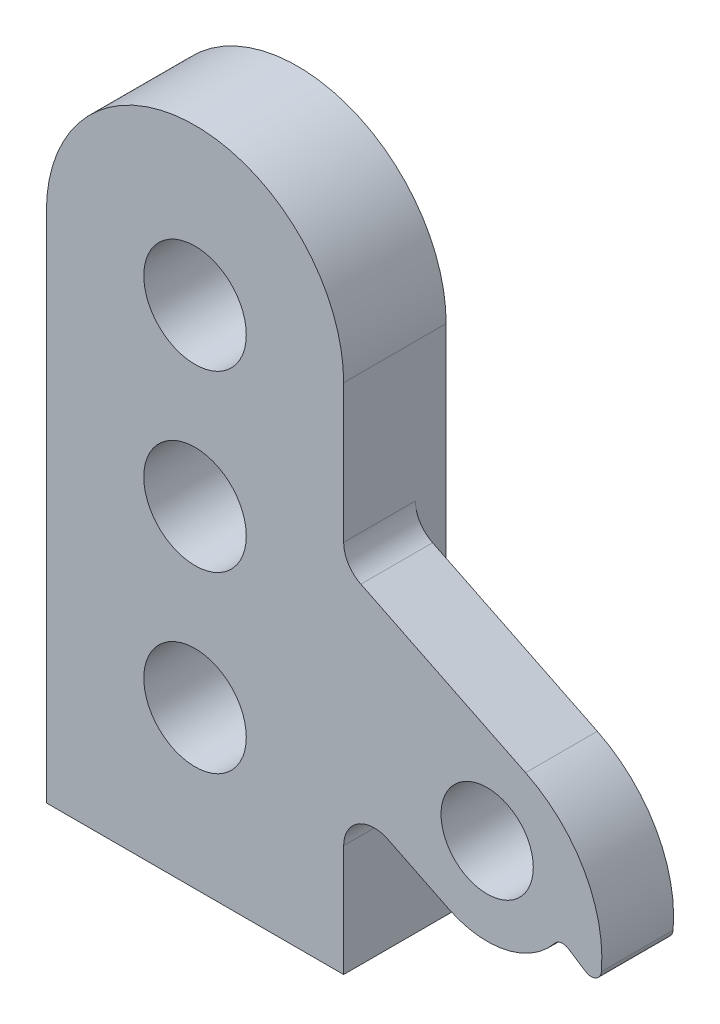
ISO-10303-21;
HEADER;
FILE_DESCRIPTION(('STEP AP214'),'2;1');
FILE_NAME('part.step','',(''),(''),'','','');
FILE_SCHEMA(('AUTOMOTIVE_DESIGN { 1 0 10303 214 1 1 1 1 }'));
ENDSEC;
DATA;
#1=APPLICATION_CONTEXT('core data for automotive mechanical design processes');
#2=APPLICATION_PROTOCOL_DEFINITION('international standard','automotive_design',2000,#1);
#3=PRODUCT_CONTEXT('',#1,'mechanical');
#4=PRODUCT('Part','Part','',(#3));
#5=PRODUCT_RELATED_PRODUCT_CATEGORY('part','',(#4));
#6=PRODUCT_DEFINITION_FORMATION('','',#4);
#7=PRODUCT_DEFINITION_CONTEXT('part definition',#1,'design');
#8=PRODUCT_DEFINITION('design','',#6,#7);
#9=PRODUCT_DEFINITION_SHAPE('','',#8);
#10=(LENGTH_UNIT() NAMED_UNIT(*) SI_UNIT(.MILLI.,.METRE.));
#11=(NAMED_UNIT(*) PLANE_ANGLE_UNIT() SI_UNIT($,.RADIAN.));
#12=(NAMED_UNIT(*) SI_UNIT($,.STERADIAN.) SOLID_ANGLE_UNIT());
#13=UNCERTAINTY_MEASURE_WITH_UNIT(LENGTH_MEASURE(1.E-05),#10,'distance_accuracy_value','');
#14=(GEOMETRIC_REPRESENTATION_CONTEXT(3) GLOBAL_UNCERTAINTY_ASSIGNED_CONTEXT((#13)) GLOBAL_UNIT_ASSIGNED_CONTEXT((#10,
#11,#12)) REPRESENTATION_CONTEXT('',''));
#15=CARTESIAN_POINT('',(0.,0.,0.));
#16=DIRECTION('',(0.,0.,1.));
#17=DIRECTION('',(1.,0.,0.));
#18=AXIS2_PLACEMENT_3D('',#15,#16,#17);
#19=CARTESIAN_POINT('',(0.,25.,-3.));
#20=DIRECTION('',(0.,0.,1.));
#21=DIRECTION('',(1.,0.,0.));
#22=AXIS2_PLACEMENT_3D('',#19,#20,#21);
#23=PLANE('',#22);
#24=CARTESIAN_POINT('',(0.,-9.70000000000001,-3.));
#25=DIRECTION('',(0.,0.,1.));
#26=DIRECTION('',(1.,0.,0.));
#27=AXIS2_PLACEMENT_3D('',#24,#25,#26);
#28=CIRCLE('',#27,5.);
#29=CARTESIAN_POINT('',(5.,-9.70000000000001,-3.));
#30=VERTEX_POINT('',#29);
#31=EDGE_CURVE('E354',#30,#30,#28,.T.);
#32=ORIENTED_EDGE('',*,*,#31,.T.);
#33=EDGE_LOOP('',(#32));
#34=FACE_BOUND('',#33,.T.);
#35=CARTESIAN_POINT('',(0.,24.3,-3.));
#36=DIRECTION('',(0.,0.,1.));
#37=DIRECTION('',(1.,0.,0.));
#38=AXIS2_PLACEMENT_3D('',#35,#36,#37);
#39=CIRCLE('',#38,5.);
#40=CARTESIAN_POINT('',(5.,24.3,-3.));
#41=VERTEX_POINT('',#40);
#42=EDGE_CURVE('E356',#41,#41,#39,.T.);
#43=ORIENTED_EDGE('',*,*,#42,.T.);
#44=EDGE_LOOP('',(#43));
#45=FACE_BOUND('',#44,.T.);
#46=CARTESIAN_POINT('',(0.,7.29999999999999,-3.));
#47=DIRECTION('',(0.,0.,-1.));
#48=DIRECTION('',(-1.,0.,0.));
#49=AXIS2_PLACEMENT_3D('',#46,#47,#48);
#50=CIRCLE('',#49,5.00000000000001);
#51=CARTESIAN_POINT('',(-5.,7.29999999999999,-3.));
#52=VERTEX_POINT('',#51);
#53=EDGE_CURVE('E291',#52,#52,#50,.T.);
#54=ORIENTED_EDGE('',*,*,#53,.F.);
#55=EDGE_LOOP('',(#54));
#56=FACE_BOUND('',#55,.T.);
#57=DIRECTION('',(1.,0.,0.));
#58=VECTOR('',#57,1.);
#59=CARTESIAN_POINT('',(-14.5,-18.,-3.));
#60=LINE('',#59,#58);
#61=CARTESIAN_POINT('',(-14.5,-18.,-3.));
#62=VERTEX_POINT('',#61);
#63=CARTESIAN_POINT('',(14.5,-18.,-3.));
#64=VERTEX_POINT('',#63);
#65=EDGE_CURVE('E54',#62,#64,#60,.T.);
#66=ORIENTED_EDGE('',*,*,#65,.F.);
#67=DIRECTION('',(0.,1.,0.));
#68=VECTOR('',#67,1.);
#69=CARTESIAN_POINT('',(-14.5,25.,-3.));
#70=LINE('',#69,#68);
#71=CARTESIAN_POINT('',(-14.5,25.,-3.));
#72=VERTEX_POINT('',#71);
#73=EDGE_CURVE('E175',#62,#72,#70,.T.);
#74=ORIENTED_EDGE('',*,*,#73,.T.);
#75=CARTESIAN_POINT('',(0.,25.,-3.));
#76=DIRECTION('',(0.,0.,-1.));
#77=DIRECTION('',(1.,0.,0.));
#78=AXIS2_PLACEMENT_3D('',#75,#76,#77);
#79=CIRCLE('',#78,14.5);
#80=CARTESIAN_POINT('',(14.5,25.,-3.));
#81=VERTEX_POINT('',#80);
#82=EDGE_CURVE('E289',#72,#81,#79,.T.);
#83=ORIENTED_EDGE('',*,*,#82,.T.);
#84=DIRECTION('',(0.,-1.,0.));
#85=VECTOR('',#84,1.);
#86=CARTESIAN_POINT('',(14.5,-25.,-3.));
#87=LINE('',#86,#85);
#88=EDGE_CURVE('E290',#81,#64,#87,.T.);
#89=ORIENTED_EDGE('',*,*,#88,.T.);
#90=EDGE_LOOP('',(#66,#74,#83,#89));
#91=FACE_BOUND('',#90,.T.);
#92=ADVANCED_FACE('F37',(#34,#45,#56,#91),#23,.F.);
#93=CARTESIAN_POINT('',(0.,0.,0.));
#94=DIRECTION('',(0.,0.,1.));
#95=DIRECTION('',(1.,0.,0.));
#96=AXIS2_PLACEMENT_3D('',#93,#94,#95);
#97=PLANE('',#96);
#98=CARTESIAN_POINT('',(28.5,-6.70000000000001,0.));
#99=DIRECTION('',(0.,0.,1.));
#100=DIRECTION('',(1.,0.,0.));
#101=AXIS2_PLACEMENT_3D('',#98,#99,#100);
#102=CIRCLE('',#101,4.5);
#103=CARTESIAN_POINT('',(33.,-6.70000000000001,0.));
#104=VERTEX_POINT('',#103);
#105=EDGE_CURVE('E171',#104,#104,#102,.T.);
#106=ORIENTED_EDGE('',*,*,#105,.T.);
#107=EDGE_LOOP('',(#106));
#108=FACE_BOUND('',#107,.T.);
#109=DIRECTION('',(0.,-1.,0.));
#110=VECTOR('',#109,1.);
#111=CARTESIAN_POINT('',(14.5,-25.,0.));
#112=LINE('',#111,#110);
#113=CARTESIAN_POINT('',(14.5,11.516103688213,0.));
#114=VERTEX_POINT('',#113);
#115=CARTESIAN_POINT('',(14.5,-14.1090861443534,0.));
#116=VERTEX_POINT('',#115);
#117=EDGE_CURVE('E11',#114,#116,#112,.T.);
#118=ORIENTED_EDGE('',*,*,#117,.F.);
#119=CARTESIAN_POINT('',(17.5,11.516103688213,0.));
#120=DIRECTION('',(0.,0.,1.));
#121=DIRECTION('',(1.,0.,0.));
#122=AXIS2_PLACEMENT_3D('',#119,#120,#121);
#123=CIRCLE('',#122,3.);
#124=CARTESIAN_POINT('',(16.1772883610396,8.82344070890074,0.));
#125=VERTEX_POINT('',#124);
#126=EDGE_CURVE('E191',#114,#125,#123,.T.);
#127=ORIENTED_EDGE('',*,*,#126,.T.);
#128=DIRECTION('',(-0.897554326437415,0.440903879653467,0.));
#129=VECTOR('',#128,1.);
#130=CARTESIAN_POINT('',(6.63654982555434,13.5101192877356,0.));
#131=LINE('',#130,#129);
#132=CARTESIAN_POINT('',(32.2476829770545,0.929211774718015,0.));
#133=VERTEX_POINT('',#132);
#134=EDGE_CURVE('E188',#133,#125,#131,.T.);
#135=ORIENTED_EDGE('',*,*,#134,.F.);
#136=CARTESIAN_POINT('',(26.3790265018417,-11.0176960498222,0.));
#137=DIRECTION('',(0.,0.,1.));
#138=DIRECTION('',(1.,0.,0.));
#139=AXIS2_PLACEMENT_3D('',#136,#137,#138);
#140=CIRCLE('',#139,13.3105122137399);
#141=CARTESIAN_POINT('',(39.6377712447958,-12.1904804431811,0.));
#142=VERTEX_POINT('',#141);
#143=EDGE_CURVE('E185',#133,#142,#140,.F.);
#144=ORIENTED_EDGE('',*,*,#143,.T.);
#145=CARTESIAN_POINT('',(38.6416604618262,-12.1023708066379,0.));
#146=DIRECTION('',(0.,0.,1.));
#147=DIRECTION('',(1.,0.,0.));
#148=AXIS2_PLACEMENT_3D('',#145,#146,#147);
#149=CIRCLE('',#148,0.999999999999944);
#150=CARTESIAN_POINT('',(38.0964892709571,-12.9406955483974,0.));
#151=VERTEX_POINT('',#150);
#152=EDGE_CURVE('E182',#142,#151,#149,.F.);
#153=ORIENTED_EDGE('',*,*,#152,.T.);
#154=DIRECTION('',(0.838324741759615,-0.545171190869139,0.));
#155=VECTOR('',#154,1.);
#156=CARTESIAN_POINT('',(5.40842704431872,8.31668709057398,0.));
#157=LINE('',#156,#155);
#158=CARTESIAN_POINT('',(36.4198397874379,-11.8503531666591,0.));
#159=VERTEX_POINT('',#158);
#160=EDGE_CURVE('E179',#159,#151,#157,.T.);
#161=ORIENTED_EDGE('',*,*,#160,.F.);
#162=CARTESIAN_POINT('',(35.8746685965687,-12.6886779084188,0.));
#163=DIRECTION('',(0.,0.,1.));
#164=DIRECTION('',(1.,0.,0.));
#165=AXIS2_PLACEMENT_3D('',#162,#163,#164);
#166=CIRCLE('',#165,1.00000000000007);
#167=CARTESIAN_POINT('',(35.0983876916668,-12.0582907601641,0.));
#168=VERTEX_POINT('',#167);
#169=EDGE_CURVE('E177',#168,#159,#166,.F.);
#170=ORIENTED_EDGE('',*,*,#169,.F.);
#171=CARTESIAN_POINT('',(28.5,-6.70000000000001,0.));
#172=DIRECTION('',(0.,0.,1.));
#173=DIRECTION('',(1.,0.,0.));
#174=AXIS2_PLACEMENT_3D('',#171,#172,#173);
#175=CIRCLE('',#174,8.5);
#176=CARTESIAN_POINT('',(24.7523170229455,-14.329211774718,0.));
#177=VERTEX_POINT('',#176);
#178=EDGE_CURVE('E174',#177,#168,#175,.T.);
#179=ORIENTED_EDGE('',*,*,#178,.F.);
#180=DIRECTION('',(-0.897554326437415,0.440903879653467,0.));
#181=VECTOR('',#180,1.);
#182=CARTESIAN_POINT('',(-0.858816128554595,-1.74830426170043,0.));
#183=LINE('',#182,#181);
#184=CARTESIAN_POINT('',(18.8227116389605,-11.4164231650412,0.));
#185=VERTEX_POINT('',#184);
#186=EDGE_CURVE('E196',#177,#185,#183,.T.);
#187=ORIENTED_EDGE('',*,*,#186,.T.);
#188=CARTESIAN_POINT('',(17.5,-14.1090861443534,0.));
#189=DIRECTION('',(0.,0.,1.));
#190=DIRECTION('',(1.,0.,0.));
#191=AXIS2_PLACEMENT_3D('',#188,#189,#190);
#192=CIRCLE('',#191,3.);
#193=EDGE_CURVE('E194',#116,#185,#192,.F.);
#194=ORIENTED_EDGE('',*,*,#193,.F.);
#195=EDGE_LOOP('',(#118,#127,#135,#144,#153,#161,#170,#179,#187,#194));
#196=FACE_BOUND('',#195,.T.);
#197=ADVANCED_FACE('F228',(#108,#196),#97,.F.);
#198=CARTESIAN_POINT('',(28.5,-6.70000000000001,7.));
#199=DIRECTION('',(0.,0.,-1.));
#200=DIRECTION('',(-1.,0.,0.));
#201=AXIS2_PLACEMENT_3D('',#198,#199,#200);
#202=CYLINDRICAL_SURFACE('',#201,8.5);
#203=ORIENTED_EDGE('',*,*,#178,.T.);
#204=DIRECTION('',(0.,0.,-1.));
#205=VECTOR('',#204,1.);
#206=CARTESIAN_POINT('',(35.0983876916668,-12.0582907601641,7.));
#207=LINE('',#206,#205);
#208=CARTESIAN_POINT('',(35.0983876916668,-12.0582907601641,7.));
#209=VERTEX_POINT('',#208);
#210=EDGE_CURVE('E46',#209,#168,#207,.T.);
#211=ORIENTED_EDGE('',*,*,#210,.F.);
#212=CARTESIAN_POINT('',(28.5,-6.70000000000001,7.));
#213=DIRECTION('',(0.,0.,1.));
#214=DIRECTION('',(1.,0.,0.));
#215=AXIS2_PLACEMENT_3D('',#212,#213,#214);
#216=CIRCLE('',#215,8.5);
#217=CARTESIAN_POINT('',(24.7523170229455,-14.329211774718,7.));
#218=VERTEX_POINT('',#217);
#219=EDGE_CURVE('E265',#218,#209,#216,.T.);
#220=ORIENTED_EDGE('',*,*,#219,.F.);
#221=DIRECTION('',(0.,0.,-1.));
#222=VECTOR('',#221,1.);
#223=CARTESIAN_POINT('',(24.7523170229455,-14.329211774718,7.));
#224=LINE('',#223,#222);
#225=EDGE_CURVE('E63',#218,#177,#224,.T.);
#226=ORIENTED_EDGE('',*,*,#225,.T.);
#227=EDGE_LOOP('',(#203,#211,#220,#226));
#228=FACE_BOUND('',#227,.T.);
#229=ADVANCED_FACE('F226',(#228),#202,.T.);
#230=CARTESIAN_POINT('',(35.8746685965687,-12.6886779084188,7.));
#231=DIRECTION('',(0.,0.,-1.));
#232=DIRECTION('',(-1.,0.,0.));
#233=AXIS2_PLACEMENT_3D('',#230,#231,#232);
#234=CYLINDRICAL_SURFACE('',#233,1.00000000000007);
#235=ORIENTED_EDGE('',*,*,#169,.T.);
#236=DIRECTION('',(0.,0.,-1.));
#237=VECTOR('',#236,1.);
#238=CARTESIAN_POINT('',(36.4198397874379,-11.8503531666591,7.));
#239=LINE('',#238,#237);
#240=CARTESIAN_POINT('',(36.4198397874379,-11.8503531666591,7.));
#241=VERTEX_POINT('',#240);
#242=EDGE_CURVE('E222',#241,#159,#239,.T.);
#243=ORIENTED_EDGE('',*,*,#242,.F.);
#244=CARTESIAN_POINT('',(35.8746685965687,-12.6886779084188,7.));
#245=DIRECTION('',(0.,0.,1.));
#246=DIRECTION('',(1.,0.,0.));
#247=AXIS2_PLACEMENT_3D('',#244,#245,#246);
#248=CIRCLE('',#247,1.00000000000007);
#249=EDGE_CURVE('E105',#209,#241,#248,.F.);
#250=ORIENTED_EDGE('',*,*,#249,.F.);
#251=ORIENTED_EDGE('',*,*,#210,.T.);
#252=EDGE_LOOP('',(#235,#243,#250,#251));
#253=FACE_BOUND('',#252,.T.);
#254=ADVANCED_FACE('F225',(#253),#234,.F.);
#255=CARTESIAN_POINT('',(5.40842704431872,8.31668709057398,7.));
#256=DIRECTION('',(0.545171190869139,0.838324741759615,0.));
#257=DIRECTION('',(-0.838324741759615,0.545171190869139,0.));
#258=AXIS2_PLACEMENT_3D('',#255,#256,#257);
#259=PLANE('',#258);
#260=ORIENTED_EDGE('',*,*,#160,.T.);
#261=DIRECTION('',(0.,0.,-1.));
#262=VECTOR('',#261,1.);
#263=CARTESIAN_POINT('',(38.0964892709571,-12.9406955483974,7.));
#264=LINE('',#263,#262);
#265=CARTESIAN_POINT('',(38.0964892709571,-12.9406955483974,7.));
#266=VERTEX_POINT('',#265);
#267=EDGE_CURVE('E220',#266,#151,#264,.T.);
#268=ORIENTED_EDGE('',*,*,#267,.F.);
#269=DIRECTION('',(0.838324741759615,-0.545171190869139,0.));
#270=VECTOR('',#269,1.);
#271=CARTESIAN_POINT('',(5.40842704431872,8.31668709057398,7.));
#272=LINE('',#271,#270);
#273=EDGE_CURVE('E261',#241,#266,#272,.T.);
#274=ORIENTED_EDGE('',*,*,#273,.F.);
#275=ORIENTED_EDGE('',*,*,#242,.T.);
#276=EDGE_LOOP('',(#260,#268,#274,#275));
#277=FACE_BOUND('',#276,.T.);
#278=ADVANCED_FACE('F259',(#277),#259,.F.);
#279=CARTESIAN_POINT('',(38.6416604618262,-12.1023708066379,7.));
#280=DIRECTION('',(0.,0.,-1.));
#281=DIRECTION('',(-1.,0.,0.));
#282=AXIS2_PLACEMENT_3D('',#279,#280,#281);
#283=CYLINDRICAL_SURFACE('',#282,0.999999999999944);
#284=ORIENTED_EDGE('',*,*,#152,.F.);
#285=DIRECTION('',(0.,0.,-1.));
#286=VECTOR('',#285,1.);
#287=CARTESIAN_POINT('',(39.6377712447958,-12.1904804431811,7.));
#288=LINE('',#287,#286);
#289=CARTESIAN_POINT('',(39.6377712447958,-12.1904804431811,7.));
#290=VERTEX_POINT('',#289);
#291=EDGE_CURVE('E218',#290,#142,#288,.T.);
#292=ORIENTED_EDGE('',*,*,#291,.F.);
#293=CARTESIAN_POINT('',(38.6416604618262,-12.1023708066379,7.));
#294=DIRECTION('',(0.,0.,1.));
#295=DIRECTION('',(1.,0.,0.));
#296=AXIS2_PLACEMENT_3D('',#293,#294,#295);
#297=CIRCLE('',#296,0.999999999999944);
#298=EDGE_CURVE('E262',#290,#266,#297,.F.);
#299=ORIENTED_EDGE('',*,*,#298,.T.);
#300=ORIENTED_EDGE('',*,*,#267,.T.);
#301=EDGE_LOOP('',(#284,#292,#299,#300));
#302=FACE_BOUND('',#301,.T.);
#303=ADVANCED_FACE('F256',(#302),#283,.T.);
#304=CARTESIAN_POINT('',(26.3790265018417,-11.0176960498222,7.));
#305=DIRECTION('',(0.,0.,-1.));
#306=DIRECTION('',(-1.,0.,0.));
#307=AXIS2_PLACEMENT_3D('',#304,#305,#306);
#308=CYLINDRICAL_SURFACE('',#307,13.3105122137399);
#309=ORIENTED_EDGE('',*,*,#143,.F.);
#310=DIRECTION('',(0.,0.,-1.));
#311=VECTOR('',#310,1.);
#312=CARTESIAN_POINT('',(32.2476829770545,0.929211774718015,7.));
#313=LINE('',#312,#311);
#314=CARTESIAN_POINT('',(32.2476829770545,0.929211774718015,7.));
#315=VERTEX_POINT('',#314);
#316=EDGE_CURVE('E216',#315,#133,#313,.T.);
#317=ORIENTED_EDGE('',*,*,#316,.F.);
#318=CARTESIAN_POINT('',(26.3790265018417,-11.0176960498222,7.));
#319=DIRECTION('',(0.,0.,1.));
#320=DIRECTION('',(1.,0.,0.));
#321=AXIS2_PLACEMENT_3D('',#318,#319,#320);
#322=CIRCLE('',#321,13.3105122137399);
#323=EDGE_CURVE('E252',#315,#290,#322,.F.);
#324=ORIENTED_EDGE('',*,*,#323,.T.);
#325=ORIENTED_EDGE('',*,*,#291,.T.);
#326=EDGE_LOOP('',(#309,#317,#324,#325));
#327=FACE_BOUND('',#326,.T.);
#328=ADVANCED_FACE('F248',(#327),#308,.T.);
#329=CARTESIAN_POINT('',(6.63654982555434,13.5101192877356,7.));
#330=DIRECTION('',(-0.440903879653467,-0.897554326437415,0.));
#331=DIRECTION('',(0.897554326437415,-0.440903879653467,0.));
#332=AXIS2_PLACEMENT_3D('',#329,#330,#331);
#333=PLANE('',#332);
#334=ORIENTED_EDGE('',*,*,#134,.T.);
#335=DIRECTION('',(0.,0.,-1.));
#336=VECTOR('',#335,1.);
#337=CARTESIAN_POINT('',(16.1772883610396,8.82344070890074,7.));
#338=LINE('',#337,#336);
#339=CARTESIAN_POINT('',(16.1772883610396,8.82344070890074,7.));
#340=VERTEX_POINT('',#339);
#341=EDGE_CURVE('E214',#340,#125,#338,.T.);
#342=ORIENTED_EDGE('',*,*,#341,.F.);
#343=DIRECTION('',(-0.897554326437415,0.440903879653467,0.));
#344=VECTOR('',#343,1.);
#345=CARTESIAN_POINT('',(6.63654982555434,13.5101192877356,7.));
#346=LINE('',#345,#344);
#347=EDGE_CURVE('E270',#315,#340,#346,.T.);
#348=ORIENTED_EDGE('',*,*,#347,.F.);
#349=ORIENTED_EDGE('',*,*,#316,.T.);
#350=EDGE_LOOP('',(#334,#342,#348,#349));
#351=FACE_BOUND('',#350,.T.);
#352=ADVANCED_FACE('F245',(#351),#333,.F.);
#353=CARTESIAN_POINT('',(17.5,11.516103688213,7.));
#354=DIRECTION('',(0.,0.,-1.));
#355=DIRECTION('',(-1.,0.,0.));
#356=AXIS2_PLACEMENT_3D('',#353,#354,#355);
#357=CYLINDRICAL_SURFACE('',#356,3.);
#358=ORIENTED_EDGE('',*,*,#126,.F.);
#359=DIRECTION('',(0.,0.,-1.));
#360=VECTOR('',#359,1.);
#361=CARTESIAN_POINT('',(14.5,11.516103688213,7.));
#362=LINE('',#361,#360);
#363=CARTESIAN_POINT('',(14.5,11.516103688213,7.));
#364=VERTEX_POINT('',#363);
#365=EDGE_CURVE('E212',#364,#114,#362,.T.);
#366=ORIENTED_EDGE('',*,*,#365,.F.);
#367=CARTESIAN_POINT('',(17.5,11.516103688213,7.));
#368=DIRECTION('',(0.,0.,1.));
#369=DIRECTION('',(1.,0.,0.));
#370=AXIS2_PLACEMENT_3D('',#367,#368,#369);
#371=CIRCLE('',#370,3.);
#372=EDGE_CURVE('E242',#364,#340,#371,.T.);
#373=ORIENTED_EDGE('',*,*,#372,.T.);
#374=ORIENTED_EDGE('',*,*,#341,.T.);
#375=EDGE_LOOP('',(#358,#366,#373,#374));
#376=FACE_BOUND('',#375,.T.);
#377=ADVANCED_FACE('F240',(#376),#357,.F.);
#378=CARTESIAN_POINT('',(0.,25.,7.));
#379=DIRECTION('',(0.,0.,-1.));
#380=DIRECTION('',(-1.,0.,0.));
#381=AXIS2_PLACEMENT_3D('',#378,#379,#380);
#382=CYLINDRICAL_SURFACE('',#381,14.5);
#383=DIRECTION('',(0.,0.,-1.));
#384=VECTOR('',#383,1.);
#385=CARTESIAN_POINT('',(14.5,25.,7.));
#386=LINE('',#385,#384);
#387=CARTESIAN_POINT('',(14.5,25.,7.));
#388=VERTEX_POINT('',#387);
#389=EDGE_CURVE('E209',#388,#81,#386,.T.);
#390=ORIENTED_EDGE('',*,*,#389,.T.);
#391=ORIENTED_EDGE('',*,*,#82,.F.);
#392=DIRECTION('',(0.,0.,-1.));
#393=VECTOR('',#392,1.);
#394=CARTESIAN_POINT('',(-14.5,25.,7.));
#395=LINE('',#394,#393);
#396=CARTESIAN_POINT('',(-14.5,25.,7.));
#397=VERTEX_POINT('',#396);
#398=EDGE_CURVE('E206',#397,#72,#395,.T.);
#399=ORIENTED_EDGE('',*,*,#398,.F.);
#400=CARTESIAN_POINT('',(0.,25.,7.));
#401=DIRECTION('',(0.,0.,1.));
#402=DIRECTION('',(1.,0.,0.));
#403=AXIS2_PLACEMENT_3D('',#400,#401,#402);
#404=CIRCLE('',#403,14.5);
#405=EDGE_CURVE('E274',#397,#388,#404,.F.);
#406=ORIENTED_EDGE('',*,*,#405,.T.);
#407=EDGE_LOOP('',(#390,#391,#399,#406));
#408=FACE_BOUND('',#407,.T.);
#409=ADVANCED_FACE('F285',(#408),#382,.T.);
#410=CARTESIAN_POINT('',(-14.5,0.,7.));
#411=DIRECTION('',(-1.,0.,0.));
#412=DIRECTION('',(0.,0.,1.));
#413=AXIS2_PLACEMENT_3D('',#410,#411,#412);
#414=PLANE('',#413);
#415=ORIENTED_EDGE('',*,*,#398,.T.);
#416=ORIENTED_EDGE('',*,*,#73,.F.);
#417=DIRECTION('',(0.,0.,1.));
#418=VECTOR('',#417,1.);
#419=CARTESIAN_POINT('',(-14.5,-18.,-11.));
#420=LINE('',#419,#418);
#421=CARTESIAN_POINT('',(-14.5,-18.,-11.));
#422=VERTEX_POINT('',#421);
#423=EDGE_CURVE('E295',#422,#62,#420,.T.);
#424=ORIENTED_EDGE('',*,*,#423,.F.);
#425=DIRECTION('',(0.,1.,0.));
#426=VECTOR('',#425,1.);
#427=CARTESIAN_POINT('',(-14.5,-25.,-11.));
#428=LINE('',#427,#426);
#429=CARTESIAN_POINT('',(-14.5,-25.,-11.));
#430=VERTEX_POINT('',#429);
#431=EDGE_CURVE('E364',#430,#422,#428,.T.);
#432=ORIENTED_EDGE('',*,*,#431,.F.);
#433=DIRECTION('',(0.,0.,-1.));
#434=VECTOR('',#433,1.);
#435=CARTESIAN_POINT('',(-14.5,-25.,7.));
#436=LINE('',#435,#434);
#437=CARTESIAN_POINT('',(-14.5,-25.,7.));
#438=VERTEX_POINT('',#437);
#439=EDGE_CURVE('E203',#438,#430,#436,.T.);
#440=ORIENTED_EDGE('',*,*,#439,.F.);
#441=DIRECTION('',(0.,1.,0.));
#442=VECTOR('',#441,1.);
#443=CARTESIAN_POINT('',(-14.5,0.,7.));
#444=LINE('',#443,#442);
#445=EDGE_CURVE('E277',#438,#397,#444,.T.);
#446=ORIENTED_EDGE('',*,*,#445,.T.);
#447=EDGE_LOOP('',(#415,#416,#424,#432,#440,#446));
#448=FACE_BOUND('',#447,.T.);
#449=ADVANCED_FACE('F280',(#448),#414,.T.);
#450=CARTESIAN_POINT('',(0.,-25.,7.));
#451=DIRECTION('',(0.,1.,0.));
#452=DIRECTION('',(0.,0.,1.));
#453=AXIS2_PLACEMENT_3D('',#450,#451,#452);
#454=PLANE('',#453);
#455=CARTESIAN_POINT('',(0.,-25.,-7.));
#456=DIRECTION('',(0.,-1.,0.));
#457=DIRECTION('',(0.,0.,-1.));
#458=AXIS2_PLACEMENT_3D('',#455,#456,#457);
#459=CIRCLE('',#458,3.);
#460=CARTESIAN_POINT('',(0.,-25.,-10.));
#461=VERTEX_POINT('',#460);
#462=EDGE_CURVE('E355',#461,#461,#459,.T.);
#463=ORIENTED_EDGE('',*,*,#462,.F.);
#464=EDGE_LOOP('',(#463));
#465=FACE_BOUND('',#464,.T.);
#466=ORIENTED_EDGE('',*,*,#439,.T.);
#467=DIRECTION('',(-1.,0.,0.));
#468=VECTOR('',#467,1.);
#469=CARTESIAN_POINT('',(-14.5,-25.,-11.));
#470=LINE('',#469,#468);
#471=CARTESIAN_POINT('',(14.5,-25.,-11.));
#472=VERTEX_POINT('',#471);
#473=EDGE_CURVE('E373',#472,#430,#470,.T.);
#474=ORIENTED_EDGE('',*,*,#473,.F.);
#475=DIRECTION('',(0.,0.,-1.));
#476=VECTOR('',#475,1.);
#477=CARTESIAN_POINT('',(14.5,-25.,7.));
#478=LINE('',#477,#476);
#479=CARTESIAN_POINT('',(14.5,-25.,7.));
#480=VERTEX_POINT('',#479);
#481=EDGE_CURVE('E162',#480,#472,#478,.T.);
#482=ORIENTED_EDGE('',*,*,#481,.F.);
#483=DIRECTION('',(1.,0.,0.));
#484=VECTOR('',#483,1.);
#485=CARTESIAN_POINT('',(0.,-25.,7.));
#486=LINE('',#485,#484);
#487=EDGE_CURVE('E149',#438,#480,#486,.T.);
#488=ORIENTED_EDGE('',*,*,#487,.F.);
#489=EDGE_LOOP('',(#466,#474,#482,#488));
#490=FACE_BOUND('',#489,.T.);
#491=ADVANCED_FACE('F397',(#465,#490),#454,.F.);
#492=CARTESIAN_POINT('',(14.5,0.,7.));
#493=DIRECTION('',(-1.,0.,0.));
#494=DIRECTION('',(0.,0.,1.));
#495=AXIS2_PLACEMENT_3D('',#492,#493,#494);
#496=PLANE('',#495);
#497=ORIENTED_EDGE('',*,*,#481,.T.);
#498=DIRECTION('',(0.,-1.,0.));
#499=VECTOR('',#498,1.);
#500=CARTESIAN_POINT('',(14.5,-25.,-11.));
#501=LINE('',#500,#499);
#502=CARTESIAN_POINT('',(14.5,-18.,-11.));
#503=VERTEX_POINT('',#502);
#504=EDGE_CURVE('E370',#503,#472,#501,.T.);
#505=ORIENTED_EDGE('',*,*,#504,.F.);
#506=DIRECTION('',(0.,0.,1.));
#507=VECTOR('',#506,1.);
#508=CARTESIAN_POINT('',(14.5,-18.,-11.));
#509=LINE('',#508,#507);
#510=EDGE_CURVE('E376',#503,#64,#509,.T.);
#511=ORIENTED_EDGE('',*,*,#510,.T.);
#512=ORIENTED_EDGE('',*,*,#88,.F.);
#513=ORIENTED_EDGE('',*,*,#389,.F.);
#514=DIRECTION('',(0.,1.,0.));
#515=VECTOR('',#514,1.);
#516=CARTESIAN_POINT('',(14.5,0.,7.));
#517=LINE('',#516,#515);
#518=EDGE_CURVE('E236',#364,#388,#517,.T.);
#519=ORIENTED_EDGE('',*,*,#518,.F.);
#520=ORIENTED_EDGE('',*,*,#365,.T.);
#521=ORIENTED_EDGE('',*,*,#117,.T.);
#522=DIRECTION('',(0.,0.,-1.));
#523=VECTOR('',#522,1.);
#524=CARTESIAN_POINT('',(14.5,-14.1090861443534,7.));
#525=LINE('',#524,#523);
#526=CARTESIAN_POINT('',(14.5,-14.1090861443534,7.));
#527=VERTEX_POINT('',#526);
#528=EDGE_CURVE('E155',#527,#116,#525,.T.);
#529=ORIENTED_EDGE('',*,*,#528,.F.);
#530=DIRECTION('',(0.,1.,0.));
#531=VECTOR('',#530,1.);
#532=CARTESIAN_POINT('',(14.5,0.,7.));
#533=LINE('',#532,#531);
#534=EDGE_CURVE('E140',#480,#527,#533,.T.);
#535=ORIENTED_EDGE('',*,*,#534,.F.);
#536=EDGE_LOOP('',(#497,#505,#511,#512,#513,#519,#520,#521,#529,#535));
#537=FACE_BOUND('',#536,.T.);
#538=ADVANCED_FACE('F156',(#537),#496,.F.);
#539=CARTESIAN_POINT('',(17.5,-14.1090861443534,7.));
#540=DIRECTION('',(0.,0.,-1.));
#541=DIRECTION('',(-1.,0.,0.));
#542=AXIS2_PLACEMENT_3D('',#539,#540,#541);
#543=CYLINDRICAL_SURFACE('',#542,3.);
#544=ORIENTED_EDGE('',*,*,#193,.T.);
#545=DIRECTION('',(0.,0.,-1.));
#546=VECTOR('',#545,1.);
#547=CARTESIAN_POINT('',(18.8227116389605,-11.4164231650412,7.));
#548=LINE('',#547,#546);
#549=CARTESIAN_POINT('',(18.8227116389605,-11.4164231650412,7.));
#550=VERTEX_POINT('',#549);
#551=EDGE_CURVE('E163',#550,#185,#548,.T.);
#552=ORIENTED_EDGE('',*,*,#551,.F.);
#553=CARTESIAN_POINT('',(17.5,-14.1090861443534,7.));
#554=DIRECTION('',(0.,0.,1.));
#555=DIRECTION('',(1.,0.,0.));
#556=AXIS2_PLACEMENT_3D('',#553,#554,#555);
#557=CIRCLE('',#556,3.);
#558=EDGE_CURVE('E145',#527,#550,#557,.F.);
#559=ORIENTED_EDGE('',*,*,#558,.F.);
#560=ORIENTED_EDGE('',*,*,#528,.T.);
#561=EDGE_LOOP('',(#544,#552,#559,#560));
#562=FACE_BOUND('',#561,.T.);
#563=ADVANCED_FACE('F165',(#562),#543,.F.);
#564=CARTESIAN_POINT('',(28.5,-6.70000000000001,7.));
#565=DIRECTION('',(0.,0.,-1.));
#566=DIRECTION('',(-1.,0.,0.));
#567=AXIS2_PLACEMENT_3D('',#564,#565,#566);
#568=CYLINDRICAL_SURFACE('',#567,4.5);
#569=CARTESIAN_POINT('',(28.5,-6.70000000000001,7.));
#570=DIRECTION('',(0.,0.,1.));
#571=DIRECTION('',(1.,0.,0.));
#572=AXIS2_PLACEMENT_3D('',#569,#570,#571);
#573=CIRCLE('',#572,4.5);
#574=CARTESIAN_POINT('',(33.,-6.70000000000001,7.));
#575=VERTEX_POINT('',#574);
#576=EDGE_CURVE('E302',#575,#575,#573,.T.);
#577=ORIENTED_EDGE('',*,*,#576,.T.);
#578=EDGE_LOOP('',(#577));
#579=FACE_BOUND('',#578,.T.);
#580=ORIENTED_EDGE('',*,*,#105,.F.);
#581=EDGE_LOOP('',(#580));
#582=FACE_BOUND('',#581,.T.);
#583=ADVANCED_FACE('F306',(#579,#582),#568,.F.);
#584=CARTESIAN_POINT('',(0.,7.29999999999999,7.));
#585=DIRECTION('',(0.,0.,-1.));
#586=DIRECTION('',(-1.,0.,0.));
#587=AXIS2_PLACEMENT_3D('',#584,#585,#586);
#588=CYLINDRICAL_SURFACE('',#587,5.00000000000001);
#589=CARTESIAN_POINT('',(0.,7.29999999999999,7.));
#590=DIRECTION('',(0.,0.,1.));
#591=DIRECTION('',(1.,0.,0.));
#592=AXIS2_PLACEMENT_3D('',#589,#590,#591);
#593=CIRCLE('',#592,5.00000000000001);
#594=CARTESIAN_POINT('',(5.00000000000001,7.29999999999999,7.));
#595=VERTEX_POINT('',#594);
#596=EDGE_CURVE('E199',#595,#595,#593,.T.);
#597=ORIENTED_EDGE('',*,*,#596,.T.);
#598=EDGE_LOOP('',(#597));
#599=FACE_BOUND('',#598,.T.);
#600=ORIENTED_EDGE('',*,*,#53,.T.);
#601=EDGE_LOOP('',(#600));
#602=FACE_BOUND('',#601,.T.);
#603=ADVANCED_FACE('F39',(#599,#602),#588,.F.);
#604=CARTESIAN_POINT('',(-0.858816128554595,-1.74830426170043,7.));
#605=DIRECTION('',(-0.440903879653467,-0.897554326437415,0.));
#606=DIRECTION('',(0.897554326437415,-0.440903879653467,0.));
#607=AXIS2_PLACEMENT_3D('',#604,#605,#606);
#608=PLANE('',#607);
#609=ORIENTED_EDGE('',*,*,#186,.F.);
#610=ORIENTED_EDGE('',*,*,#225,.F.);
#611=DIRECTION('',(-0.897554326437415,0.440903879653467,0.));
#612=VECTOR('',#611,1.);
#613=CARTESIAN_POINT('',(-0.858816128554595,-1.74830426170043,7.));
#614=LINE('',#613,#612);
#615=EDGE_CURVE('E166',#218,#550,#614,.T.);
#616=ORIENTED_EDGE('',*,*,#615,.T.);
#617=ORIENTED_EDGE('',*,*,#551,.T.);
#618=EDGE_LOOP('',(#609,#610,#616,#617));
#619=FACE_BOUND('',#618,.T.);
#620=ADVANCED_FACE('F230',(#619),#608,.T.);
#621=CARTESIAN_POINT('',(0.,0.,7.));
#622=DIRECTION('',(0.,0.,1.));
#623=DIRECTION('',(1.,0.,0.));
#624=AXIS2_PLACEMENT_3D('',#621,#622,#623);
#625=PLANE('',#624);
#626=CARTESIAN_POINT('',(0.,-9.70000000000001,7.));
#627=DIRECTION('',(0.,0.,1.));
#628=DIRECTION('',(1.,0.,0.));
#629=AXIS2_PLACEMENT_3D('',#626,#627,#628);
#630=CIRCLE('',#629,5.);
#631=CARTESIAN_POINT('',(5.,-9.70000000000001,7.));
#632=VERTEX_POINT('',#631);
#633=EDGE_CURVE('E352',#632,#632,#630,.T.);
#634=ORIENTED_EDGE('',*,*,#633,.F.);
#635=EDGE_LOOP('',(#634));
#636=FACE_BOUND('',#635,.T.);
#637=CARTESIAN_POINT('',(0.,24.3,7.));
#638=DIRECTION('',(0.,0.,1.));
#639=DIRECTION('',(1.,0.,0.));
#640=AXIS2_PLACEMENT_3D('',#637,#638,#639);
#641=CIRCLE('',#640,5.);
#642=CARTESIAN_POINT('',(5.,24.3,7.));
#643=VERTEX_POINT('',#642);
#644=EDGE_CURVE('E601',#643,#643,#641,.T.);
#645=ORIENTED_EDGE('',*,*,#644,.F.);
#646=EDGE_LOOP('',(#645));
#647=FACE_BOUND('',#646,.T.);
#648=ORIENTED_EDGE('',*,*,#596,.F.);
#649=EDGE_LOOP('',(#648));
#650=FACE_BOUND('',#649,.T.);
#651=ORIENTED_EDGE('',*,*,#576,.F.);
#652=EDGE_LOOP('',(#651));
#653=FACE_BOUND('',#652,.T.);
#654=ORIENTED_EDGE('',*,*,#219,.T.);
#655=ORIENTED_EDGE('',*,*,#249,.T.);
#656=ORIENTED_EDGE('',*,*,#273,.T.);
#657=ORIENTED_EDGE('',*,*,#298,.F.);
#658=ORIENTED_EDGE('',*,*,#323,.F.);
#659=ORIENTED_EDGE('',*,*,#347,.T.);
#660=ORIENTED_EDGE('',*,*,#372,.F.);
#661=ORIENTED_EDGE('',*,*,#518,.T.);
#662=ORIENTED_EDGE('',*,*,#405,.F.);
#663=ORIENTED_EDGE('',*,*,#445,.F.);
#664=ORIENTED_EDGE('',*,*,#487,.T.);
#665=ORIENTED_EDGE('',*,*,#534,.T.);
#666=ORIENTED_EDGE('',*,*,#558,.T.);
#667=ORIENTED_EDGE('',*,*,#615,.F.);
#668=EDGE_LOOP('',(#654,#655,#656,#657,#658,#659,#660,#661,#662,#663,#664,#665,#666,#667));
#669=FACE_BOUND('',#668,.T.);
#670=ADVANCED_FACE('F142',(#636,#647,#650,#653,#669),#625,.T.);
#671=CARTESIAN_POINT('',(-14.5,-18.,-11.));
#672=DIRECTION('',(0.,-1.,0.));
#673=DIRECTION('',(1.,0.,0.));
#674=AXIS2_PLACEMENT_3D('',#671,#672,#673);
#675=PLANE('',#674);
#676=CARTESIAN_POINT('',(0.,-18.,-7.));
#677=DIRECTION('',(0.,-1.,0.));
#678=DIRECTION('',(1.,0.,0.));
#679=AXIS2_PLACEMENT_3D('',#676,#677,#678);
#680=CIRCLE('',#679,3.);
#681=CARTESIAN_POINT('',(3.,-18.,-7.));
#682=VERTEX_POINT('',#681);
#683=EDGE_CURVE('E41',#682,#682,#680,.T.);
#684=ORIENTED_EDGE('',*,*,#683,.T.);
#685=EDGE_LOOP('',(#684));
#686=FACE_BOUND('',#685,.T.);
#687=ORIENTED_EDGE('',*,*,#65,.T.);
#688=ORIENTED_EDGE('',*,*,#510,.F.);
#689=DIRECTION('',(1.,0.,0.));
#690=VECTOR('',#689,1.);
#691=CARTESIAN_POINT('',(-14.5,-18.,-11.));
#692=LINE('',#691,#690);
#693=EDGE_CURVE('E367',#422,#503,#692,.T.);
#694=ORIENTED_EDGE('',*,*,#693,.F.);
#695=ORIENTED_EDGE('',*,*,#423,.T.);
#696=EDGE_LOOP('',(#687,#688,#694,#695));
#697=FACE_BOUND('',#696,.T.);
#698=ADVANCED_FACE('F310',(#686,#697),#675,.F.);
#699=CARTESIAN_POINT('',(0.,0.,-11.));
#700=DIRECTION('',(0.,0.,-1.));
#701=DIRECTION('',(-1.,0.,0.));
#702=AXIS2_PLACEMENT_3D('',#699,#700,#701);
#703=PLANE('',#702);
#704=ORIENTED_EDGE('',*,*,#431,.T.);
#705=ORIENTED_EDGE('',*,*,#693,.T.);
#706=ORIENTED_EDGE('',*,*,#504,.T.);
#707=ORIENTED_EDGE('',*,*,#473,.T.);
#708=EDGE_LOOP('',(#704,#705,#706,#707));
#709=FACE_BOUND('',#708,.T.);
#710=ADVANCED_FACE('F317',(#709),#703,.T.);
#711=CARTESIAN_POINT('',(0.,39.5,-7.));
#712=DIRECTION('',(0.,-1.,0.));
#713=DIRECTION('',(0.,0.,-1.));
#714=AXIS2_PLACEMENT_3D('',#711,#712,#713);
#715=CYLINDRICAL_SURFACE('',#714,3.);
#716=ORIENTED_EDGE('',*,*,#462,.T.);
#717=EDGE_LOOP('',(#716));
#718=FACE_BOUND('',#717,.T.);
#719=ORIENTED_EDGE('',*,*,#683,.F.);
#720=EDGE_LOOP('',(#719));
#721=FACE_BOUND('',#720,.T.);
#722=ADVANCED_FACE('F336',(#718,#721),#715,.F.);
#723=CARTESIAN_POINT('',(0.,24.3,-11.));
#724=DIRECTION('',(0.,0.,1.));
#725=DIRECTION('',(1.,0.,0.));
#726=AXIS2_PLACEMENT_3D('',#723,#724,#725);
#727=CYLINDRICAL_SURFACE('',#726,5.);
#728=ORIENTED_EDGE('',*,*,#644,.T.);
#729=EDGE_LOOP('',(#728));
#730=FACE_BOUND('',#729,.T.);
#731=ORIENTED_EDGE('',*,*,#42,.F.);
#732=EDGE_LOOP('',(#731));
#733=FACE_BOUND('',#732,.T.);
#734=ADVANCED_FACE('F340',(#730,#733),#727,.F.);
#735=CARTESIAN_POINT('',(0.,-9.70000000000001,-11.));
#736=DIRECTION('',(0.,0.,1.));
#737=DIRECTION('',(1.,0.,0.));
#738=AXIS2_PLACEMENT_3D('',#735,#736,#737);
#739=CYLINDRICAL_SURFACE('',#738,5.);
#740=ORIENTED_EDGE('',*,*,#633,.T.);
#741=EDGE_LOOP('',(#740));
#742=FACE_BOUND('',#741,.T.);
#743=ORIENTED_EDGE('',*,*,#31,.F.);
#744=EDGE_LOOP('',(#743));
#745=FACE_BOUND('',#744,.T.);
#746=ADVANCED_FACE('F344',(#742,#745),#739,.F.);
#747=CLOSED_SHELL('',(#92,#197,#229,#254,#278,#303,#328,#352,#377,#409,#449,#491,#538,#563,#583,
#603,#620,#670,#698,#710,#722,#734,#746));
#748=MANIFOLD_SOLID_BREP('B2',#747);
#749=ADVANCED_BREP_SHAPE_REPRESENTATION('',(#18,#748),#14);
#750=SHAPE_DEFINITION_REPRESENTATION(#9,#749);
ENDSEC;
END-ISO-10303-21;
